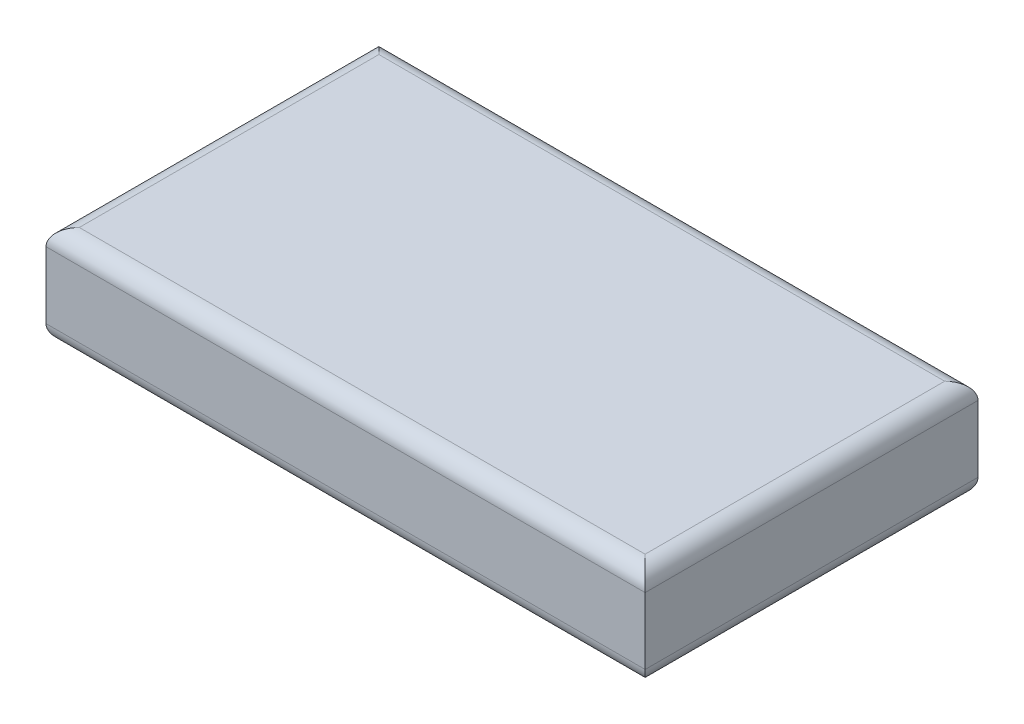
ISO-10303-21;
HEADER;
FILE_DESCRIPTION(('STEP AP214'),'2;1');
FILE_NAME('part.step','',(''),(''),'','','');
FILE_SCHEMA(('AUTOMOTIVE_DESIGN { 1 0 10303 214 1 1 1 1 }'));
ENDSEC;
DATA;
#1=APPLICATION_CONTEXT('core data for automotive mechanical design processes');
#2=APPLICATION_PROTOCOL_DEFINITION('international standard','automotive_design',2000,#1);
#3=PRODUCT_CONTEXT('',#1,'mechanical');
#4=PRODUCT('Part','Part','',(#3));
#5=PRODUCT_RELATED_PRODUCT_CATEGORY('part','',(#4));
#6=PRODUCT_DEFINITION_FORMATION('','',#4);
#7=PRODUCT_DEFINITION_CONTEXT('part definition',#1,'design');
#8=PRODUCT_DEFINITION('design','',#6,#7);
#9=PRODUCT_DEFINITION_SHAPE('','',#8);
#10=(LENGTH_UNIT() NAMED_UNIT(*) SI_UNIT(.MILLI.,.METRE.));
#11=(NAMED_UNIT(*) PLANE_ANGLE_UNIT() SI_UNIT($,.RADIAN.));
#12=(NAMED_UNIT(*) SI_UNIT($,.STERADIAN.) SOLID_ANGLE_UNIT());
#13=UNCERTAINTY_MEASURE_WITH_UNIT(LENGTH_MEASURE(1.E-05),#10,'distance_accuracy_value','');
#14=(GEOMETRIC_REPRESENTATION_CONTEXT(3) GLOBAL_UNCERTAINTY_ASSIGNED_CONTEXT((#13)) GLOBAL_UNIT_ASSIGNED_CONTEXT((#10,
#11,#12)) REPRESENTATION_CONTEXT('',''));
#15=CARTESIAN_POINT('',(0.,0.,0.));
#16=DIRECTION('',(0.,0.,1.));
#17=DIRECTION('',(1.,0.,0.));
#18=AXIS2_PLACEMENT_3D('',#15,#16,#17);
#19=CARTESIAN_POINT('',(18.,6.,-10.));
#20=DIRECTION('',(-1.,0.,0.));
#21=DIRECTION('',(0.,0.,1.));
#22=AXIS2_PLACEMENT_3D('',#19,#20,#21);
#23=PLANE('',#22);
#24=DIRECTION('',(0.,-1.,0.));
#25=VECTOR('',#24,1.);
#26=CARTESIAN_POINT('',(18.,6.,10.));
#27=LINE('',#26,#25);
#28=CARTESIAN_POINT('',(18.,5.,10.));
#29=VERTEX_POINT('',#28);
#30=CARTESIAN_POINT('',(18.,1.,10.));
#31=VERTEX_POINT('',#30);
#32=EDGE_CURVE('E143',#29,#31,#27,.T.);
#33=ORIENTED_EDGE('',*,*,#32,.T.);
#34=DIRECTION('',(0.,0.,-1.));
#35=VECTOR('',#34,1.);
#36=CARTESIAN_POINT('',(18.,1.,-10.));
#37=LINE('',#36,#35);
#38=CARTESIAN_POINT('',(18.,1.,-10.));
#39=VERTEX_POINT('',#38);
#40=EDGE_CURVE('E152',#31,#39,#37,.T.);
#41=ORIENTED_EDGE('',*,*,#40,.T.);
#42=DIRECTION('',(0.,-1.,0.));
#43=VECTOR('',#42,1.);
#44=CARTESIAN_POINT('',(18.,6.,-10.));
#45=LINE('',#44,#43);
#46=CARTESIAN_POINT('',(18.,5.,-10.));
#47=VERTEX_POINT('',#46);
#48=EDGE_CURVE('E121',#47,#39,#45,.T.);
#49=ORIENTED_EDGE('',*,*,#48,.F.);
#50=DIRECTION('',(0.,0.,-1.));
#51=VECTOR('',#50,1.);
#52=CARTESIAN_POINT('',(18.,5.,10.));
#53=LINE('',#52,#51);
#54=EDGE_CURVE('E154',#47,#29,#53,.F.);
#55=ORIENTED_EDGE('',*,*,#54,.T.);
#56=EDGE_LOOP('',(#33,#41,#49,#55));
#57=FACE_BOUND('',#56,.T.);
#58=ADVANCED_FACE('F34',(#57),#23,.F.);
#59=CARTESIAN_POINT('',(-18.,6.,-10.));
#60=DIRECTION('',(0.,0.,1.));
#61=DIRECTION('',(1.,0.,0.));
#62=AXIS2_PLACEMENT_3D('',#59,#60,#61);
#63=PLANE('',#62);
#64=ORIENTED_EDGE('',*,*,#48,.T.);
#65=DIRECTION('',(-1.,0.,0.));
#66=VECTOR('',#65,1.);
#67=CARTESIAN_POINT('',(-18.,1.,-10.));
#68=LINE('',#67,#66);
#69=CARTESIAN_POINT('',(-18.,1.,-10.));
#70=VERTEX_POINT('',#69);
#71=EDGE_CURVE('E120',#39,#70,#68,.T.);
#72=ORIENTED_EDGE('',*,*,#71,.T.);
#73=DIRECTION('',(0.,-1.,0.));
#74=VECTOR('',#73,1.);
#75=CARTESIAN_POINT('',(-18.,6.,-10.));
#76=LINE('',#75,#74);
#77=CARTESIAN_POINT('',(-18.,5.,-10.));
#78=VERTEX_POINT('',#77);
#79=EDGE_CURVE('E103',#78,#70,#76,.T.);
#80=ORIENTED_EDGE('',*,*,#79,.F.);
#81=DIRECTION('',(-1.,0.,0.));
#82=VECTOR('',#81,1.);
#83=CARTESIAN_POINT('',(18.,5.,-10.));
#84=LINE('',#83,#82);
#85=EDGE_CURVE('E117',#78,#47,#84,.F.);
#86=ORIENTED_EDGE('',*,*,#85,.T.);
#87=EDGE_LOOP('',(#64,#72,#80,#86));
#88=FACE_BOUND('',#87,.T.);
#89=ADVANCED_FACE('F116',(#88),#63,.F.);
#90=CARTESIAN_POINT('',(-18.,6.,-10.));
#91=DIRECTION('',(1.,0.,0.));
#92=DIRECTION('',(0.,0.,-1.));
#93=AXIS2_PLACEMENT_3D('',#90,#91,#92);
#94=PLANE('',#93);
#95=ORIENTED_EDGE('',*,*,#79,.T.);
#96=DIRECTION('',(0.,0.,1.));
#97=VECTOR('',#96,1.);
#98=CARTESIAN_POINT('',(-18.,1.,-10.));
#99=LINE('',#98,#97);
#100=CARTESIAN_POINT('',(-18.,1.,10.));
#101=VERTEX_POINT('',#100);
#102=EDGE_CURVE('E109',#70,#101,#99,.T.);
#103=ORIENTED_EDGE('',*,*,#102,.T.);
#104=DIRECTION('',(0.,-1.,0.));
#105=VECTOR('',#104,1.);
#106=CARTESIAN_POINT('',(-18.,6.,10.));
#107=LINE('',#106,#105);
#108=CARTESIAN_POINT('',(-18.,5.,10.));
#109=VERTEX_POINT('',#108);
#110=EDGE_CURVE('E105',#109,#101,#107,.T.);
#111=ORIENTED_EDGE('',*,*,#110,.F.);
#112=DIRECTION('',(0.,0.,1.));
#113=VECTOR('',#112,1.);
#114=CARTESIAN_POINT('',(-18.,5.,-10.));
#115=LINE('',#114,#113);
#116=EDGE_CURVE('E100',#109,#78,#115,.F.);
#117=ORIENTED_EDGE('',*,*,#116,.T.);
#118=EDGE_LOOP('',(#95,#103,#111,#117));
#119=FACE_BOUND('',#118,.T.);
#120=ADVANCED_FACE('F102',(#119),#94,.F.);
#121=CARTESIAN_POINT('',(-18.,6.,10.));
#122=DIRECTION('',(0.,0.,-1.));
#123=DIRECTION('',(-1.,0.,0.));
#124=AXIS2_PLACEMENT_3D('',#121,#122,#123);
#125=PLANE('',#124);
#126=ORIENTED_EDGE('',*,*,#110,.T.);
#127=DIRECTION('',(1.,0.,0.));
#128=VECTOR('',#127,1.);
#129=CARTESIAN_POINT('',(-18.,1.,10.));
#130=LINE('',#129,#128);
#131=EDGE_CURVE('E156',#101,#31,#130,.T.);
#132=ORIENTED_EDGE('',*,*,#131,.T.);
#133=ORIENTED_EDGE('',*,*,#32,.F.);
#134=DIRECTION('',(1.,0.,0.));
#135=VECTOR('',#134,1.);
#136=CARTESIAN_POINT('',(-18.,5.,10.));
#137=LINE('',#136,#135);
#138=EDGE_CURVE('E158',#29,#109,#137,.F.);
#139=ORIENTED_EDGE('',*,*,#138,.T.);
#140=EDGE_LOOP('',(#126,#132,#133,#139));
#141=FACE_BOUND('',#140,.T.);
#142=ADVANCED_FACE('F196',(#141),#125,.F.);
#143=CARTESIAN_POINT('',(0.,6.,0.));
#144=DIRECTION('',(0.,1.,0.));
#145=DIRECTION('',(0.,0.,1.));
#146=AXIS2_PLACEMENT_3D('',#143,#144,#145);
#147=PLANE('',#146);
#148=DIRECTION('',(0.,0.,1.));
#149=VECTOR('',#148,1.);
#150=CARTESIAN_POINT('',(-17.,6.,10.));
#151=LINE('',#150,#149);
#152=CARTESIAN_POINT('',(-17.,6.,-9.));
#153=VERTEX_POINT('',#152);
#154=CARTESIAN_POINT('',(-17.,6.,9.));
#155=VERTEX_POINT('',#154);
#156=EDGE_CURVE('E43',#153,#155,#151,.T.);
#157=ORIENTED_EDGE('',*,*,#156,.T.);
#158=DIRECTION('',(1.,0.,0.));
#159=VECTOR('',#158,1.);
#160=CARTESIAN_POINT('',(18.,6.,9.));
#161=LINE('',#160,#159);
#162=CARTESIAN_POINT('',(17.,6.,9.));
#163=VERTEX_POINT('',#162);
#164=EDGE_CURVE('E11',#155,#163,#161,.T.);
#165=ORIENTED_EDGE('',*,*,#164,.T.);
#166=DIRECTION('',(0.,0.,-1.));
#167=VECTOR('',#166,1.);
#168=CARTESIAN_POINT('',(17.,6.,-10.));
#169=LINE('',#168,#167);
#170=CARTESIAN_POINT('',(17.,6.,-9.));
#171=VERTEX_POINT('',#170);
#172=EDGE_CURVE('E150',#163,#171,#169,.T.);
#173=ORIENTED_EDGE('',*,*,#172,.T.);
#174=DIRECTION('',(-1.,0.,0.));
#175=VECTOR('',#174,1.);
#176=CARTESIAN_POINT('',(-18.,6.,-9.));
#177=LINE('',#176,#175);
#178=EDGE_CURVE('E54',#171,#153,#177,.T.);
#179=ORIENTED_EDGE('',*,*,#178,.T.);
#180=EDGE_LOOP('',(#157,#165,#173,#179));
#181=FACE_BOUND('',#180,.T.);
#182=ADVANCED_FACE('F202',(#181),#147,.T.);
#183=CARTESIAN_POINT('',(0.,0.,0.));
#184=DIRECTION('',(0.,1.,0.));
#185=DIRECTION('',(0.,0.,1.));
#186=AXIS2_PLACEMENT_3D('',#183,#184,#185);
#187=PLANE('',#186);
#188=DIRECTION('',(0.,0.,1.));
#189=VECTOR('',#188,1.);
#190=CARTESIAN_POINT('',(-17.,0.,0.));
#191=LINE('',#190,#189);
#192=CARTESIAN_POINT('',(-17.,0.,9.));
#193=VERTEX_POINT('',#192);
#194=CARTESIAN_POINT('',(-17.,0.,-9.));
#195=VERTEX_POINT('',#194);
#196=EDGE_CURVE('E163',#193,#195,#191,.F.);
#197=ORIENTED_EDGE('',*,*,#196,.T.);
#198=DIRECTION('',(-1.,0.,0.));
#199=VECTOR('',#198,1.);
#200=CARTESIAN_POINT('',(0.,0.,-9.));
#201=LINE('',#200,#199);
#202=CARTESIAN_POINT('',(17.,0.,-9.));
#203=VERTEX_POINT('',#202);
#204=EDGE_CURVE('E110',#195,#203,#201,.F.);
#205=ORIENTED_EDGE('',*,*,#204,.T.);
#206=DIRECTION('',(0.,0.,-1.));
#207=VECTOR('',#206,1.);
#208=CARTESIAN_POINT('',(17.,0.,0.));
#209=LINE('',#208,#207);
#210=CARTESIAN_POINT('',(17.,0.,9.));
#211=VERTEX_POINT('',#210);
#212=EDGE_CURVE('E167',#203,#211,#209,.F.);
#213=ORIENTED_EDGE('',*,*,#212,.T.);
#214=DIRECTION('',(1.,0.,0.));
#215=VECTOR('',#214,1.);
#216=CARTESIAN_POINT('',(0.,0.,9.));
#217=LINE('',#216,#215);
#218=EDGE_CURVE('E165',#211,#193,#217,.F.);
#219=ORIENTED_EDGE('',*,*,#218,.T.);
#220=EDGE_LOOP('',(#197,#205,#213,#219));
#221=FACE_BOUND('',#220,.T.);
#222=ADVANCED_FACE('F204',(#221),#187,.F.);
#223=CARTESIAN_POINT('',(-18.,1.,9.));
#224=DIRECTION('',(1.,0.,0.));
#225=DIRECTION('',(0.,0.,-1.));
#226=AXIS2_PLACEMENT_3D('',#223,#224,#225);
#227=CYLINDRICAL_SURFACE('',#226,1.);
#228=CARTESIAN_POINT('',(-17.,1.,9.));
#229=DIRECTION('',(0.707106781186547,0.,0.707106781186547));
#230=DIRECTION('',(0.707106781186547,0.,-0.707106781186547));
#231=AXIS2_PLACEMENT_3D('',#228,#229,#230);
#232=ELLIPSE('',#231,1.41421356237309,1.);
#233=EDGE_CURVE('E144',#193,#101,#232,.F.);
#234=ORIENTED_EDGE('',*,*,#233,.F.);
#235=ORIENTED_EDGE('',*,*,#218,.F.);
#236=CARTESIAN_POINT('',(17.,1.,9.));
#237=DIRECTION('',(0.707106781186548,0.,-0.707106781186547));
#238=DIRECTION('',(-0.707106781186547,0.,-0.707106781186548));
#239=AXIS2_PLACEMENT_3D('',#236,#237,#238);
#240=ELLIPSE('',#239,1.41421356237309,1.);
#241=EDGE_CURVE('E140',#31,#211,#240,.T.);
#242=ORIENTED_EDGE('',*,*,#241,.F.);
#243=ORIENTED_EDGE('',*,*,#131,.F.);
#244=EDGE_LOOP('',(#234,#235,#242,#243));
#245=FACE_BOUND('',#244,.T.);
#246=ADVANCED_FACE('F183',(#245),#227,.T.);
#247=CARTESIAN_POINT('',(17.,1.,-10.));
#248=DIRECTION('',(0.,0.,-1.));
#249=DIRECTION('',(-1.,0.,0.));
#250=AXIS2_PLACEMENT_3D('',#247,#248,#249);
#251=CYLINDRICAL_SURFACE('',#250,1.);
#252=ORIENTED_EDGE('',*,*,#241,.T.);
#253=ORIENTED_EDGE('',*,*,#212,.F.);
#254=CARTESIAN_POINT('',(17.,1.,-9.));
#255=DIRECTION('',(-0.707106781186547,0.,-0.707106781186548));
#256=DIRECTION('',(0.707106781186548,0.,-0.707106781186547));
#257=AXIS2_PLACEMENT_3D('',#254,#255,#256);
#258=ELLIPSE('',#257,1.4142135623731,1.);
#259=EDGE_CURVE('E131',#39,#203,#258,.T.);
#260=ORIENTED_EDGE('',*,*,#259,.F.);
#261=ORIENTED_EDGE('',*,*,#40,.F.);
#262=EDGE_LOOP('',(#252,#253,#260,#261));
#263=FACE_BOUND('',#262,.T.);
#264=ADVANCED_FACE('F187',(#263),#251,.T.);
#265=CARTESIAN_POINT('',(-17.,1.,-10.));
#266=DIRECTION('',(0.,0.,1.));
#267=DIRECTION('',(1.,0.,0.));
#268=AXIS2_PLACEMENT_3D('',#265,#266,#267);
#269=CYLINDRICAL_SURFACE('',#268,1.);
#270=ORIENTED_EDGE('',*,*,#233,.T.);
#271=ORIENTED_EDGE('',*,*,#102,.F.);
#272=CARTESIAN_POINT('',(-17.,1.,-9.));
#273=DIRECTION('',(-0.707106781186547,0.,0.707106781186547));
#274=DIRECTION('',(0.707106781186547,0.,0.707106781186547));
#275=AXIS2_PLACEMENT_3D('',#272,#273,#274);
#276=ELLIPSE('',#275,1.41421356237309,1.);
#277=EDGE_CURVE('E130',#195,#70,#276,.F.);
#278=ORIENTED_EDGE('',*,*,#277,.F.);
#279=ORIENTED_EDGE('',*,*,#196,.F.);
#280=EDGE_LOOP('',(#270,#271,#278,#279));
#281=FACE_BOUND('',#280,.T.);
#282=ADVANCED_FACE('F195',(#281),#269,.T.);
#283=CARTESIAN_POINT('',(-18.,1.,-9.));
#284=DIRECTION('',(-1.,0.,0.));
#285=DIRECTION('',(0.,0.,1.));
#286=AXIS2_PLACEMENT_3D('',#283,#284,#285);
#287=CYLINDRICAL_SURFACE('',#286,1.);
#288=ORIENTED_EDGE('',*,*,#259,.T.);
#289=ORIENTED_EDGE('',*,*,#204,.F.);
#290=ORIENTED_EDGE('',*,*,#277,.T.);
#291=ORIENTED_EDGE('',*,*,#71,.F.);
#292=EDGE_LOOP('',(#288,#289,#290,#291));
#293=FACE_BOUND('',#292,.T.);
#294=ADVANCED_FACE('F190',(#293),#287,.T.);
#295=CARTESIAN_POINT('',(0.,5.,-9.));
#296=DIRECTION('',(1.,0.,0.));
#297=DIRECTION('',(0.,0.,-1.));
#298=AXIS2_PLACEMENT_3D('',#295,#296,#297);
#299=CYLINDRICAL_SURFACE('',#298,1.);
#300=CARTESIAN_POINT('',(17.,5.,-9.));
#301=DIRECTION('',(0.707106781186547,0.,0.707106781186548));
#302=DIRECTION('',(-0.707106781186548,0.,0.707106781186547));
#303=AXIS2_PLACEMENT_3D('',#300,#301,#302);
#304=ELLIPSE('',#303,1.4142135623731,1.);
#305=EDGE_CURVE('E126',#47,#171,#304,.T.);
#306=ORIENTED_EDGE('',*,*,#305,.F.);
#307=ORIENTED_EDGE('',*,*,#85,.F.);
#308=CARTESIAN_POINT('',(-17.,5.,-9.));
#309=DIRECTION('',(0.707106781186547,0.,-0.707106781186547));
#310=DIRECTION('',(0.707106781186547,0.,0.707106781186547));
#311=AXIS2_PLACEMENT_3D('',#308,#309,#310);
#312=ELLIPSE('',#311,1.41421356237309,1.);
#313=EDGE_CURVE('E38',#153,#78,#312,.F.);
#314=ORIENTED_EDGE('',*,*,#313,.F.);
#315=ORIENTED_EDGE('',*,*,#178,.F.);
#316=EDGE_LOOP('',(#306,#307,#314,#315));
#317=FACE_BOUND('',#316,.T.);
#318=ADVANCED_FACE('F36',(#317),#299,.T.);
#319=CARTESIAN_POINT('',(-17.,5.,0.));
#320=DIRECTION('',(0.,0.,-1.));
#321=DIRECTION('',(-1.,0.,0.));
#322=AXIS2_PLACEMENT_3D('',#319,#320,#321);
#323=CYLINDRICAL_SURFACE('',#322,1.);
#324=ORIENTED_EDGE('',*,*,#313,.T.);
#325=ORIENTED_EDGE('',*,*,#116,.F.);
#326=CARTESIAN_POINT('',(-17.,5.,9.));
#327=DIRECTION('',(-0.707106781186547,0.,-0.707106781186547));
#328=DIRECTION('',(0.707106781186547,0.,-0.707106781186547));
#329=AXIS2_PLACEMENT_3D('',#326,#327,#328);
#330=ELLIPSE('',#329,1.41421356237309,1.);
#331=EDGE_CURVE('E133',#155,#109,#330,.F.);
#332=ORIENTED_EDGE('',*,*,#331,.F.);
#333=ORIENTED_EDGE('',*,*,#156,.F.);
#334=EDGE_LOOP('',(#324,#325,#332,#333));
#335=FACE_BOUND('',#334,.T.);
#336=ADVANCED_FACE('F129',(#335),#323,.T.);
#337=CARTESIAN_POINT('',(17.,5.,0.));
#338=DIRECTION('',(0.,0.,1.));
#339=DIRECTION('',(1.,0.,0.));
#340=AXIS2_PLACEMENT_3D('',#337,#338,#339);
#341=CYLINDRICAL_SURFACE('',#340,1.);
#342=ORIENTED_EDGE('',*,*,#305,.T.);
#343=ORIENTED_EDGE('',*,*,#172,.F.);
#344=CARTESIAN_POINT('',(17.,5.,9.));
#345=DIRECTION('',(-0.707106781186548,0.,0.707106781186547));
#346=DIRECTION('',(0.707106781186547,0.,0.707106781186548));
#347=AXIS2_PLACEMENT_3D('',#344,#345,#346);
#348=ELLIPSE('',#347,1.41421356237309,1.);
#349=EDGE_CURVE('E136',#29,#163,#348,.T.);
#350=ORIENTED_EDGE('',*,*,#349,.F.);
#351=ORIENTED_EDGE('',*,*,#54,.F.);
#352=EDGE_LOOP('',(#342,#343,#350,#351));
#353=FACE_BOUND('',#352,.T.);
#354=ADVANCED_FACE('F201',(#353),#341,.T.);
#355=CARTESIAN_POINT('',(0.,5.,9.));
#356=DIRECTION('',(-1.,0.,0.));
#357=DIRECTION('',(0.,0.,1.));
#358=AXIS2_PLACEMENT_3D('',#355,#356,#357);
#359=CYLINDRICAL_SURFACE('',#358,1.);
#360=ORIENTED_EDGE('',*,*,#331,.T.);
#361=ORIENTED_EDGE('',*,*,#138,.F.);
#362=ORIENTED_EDGE('',*,*,#349,.T.);
#363=ORIENTED_EDGE('',*,*,#164,.F.);
#364=EDGE_LOOP('',(#360,#361,#362,#363));
#365=FACE_BOUND('',#364,.T.);
#366=ADVANCED_FACE('F199',(#365),#359,.T.);
#367=CLOSED_SHELL('',(#58,#89,#120,#142,#182,#222,#246,#264,#282,#294,#318,#336,#354,#366));
#368=MANIFOLD_SOLID_BREP('B2',#367);
#369=ADVANCED_BREP_SHAPE_REPRESENTATION('',(#18,#368),#14);
#370=SHAPE_DEFINITION_REPRESENTATION(#9,#369);
ENDSEC;
END-ISO-10303-21;
